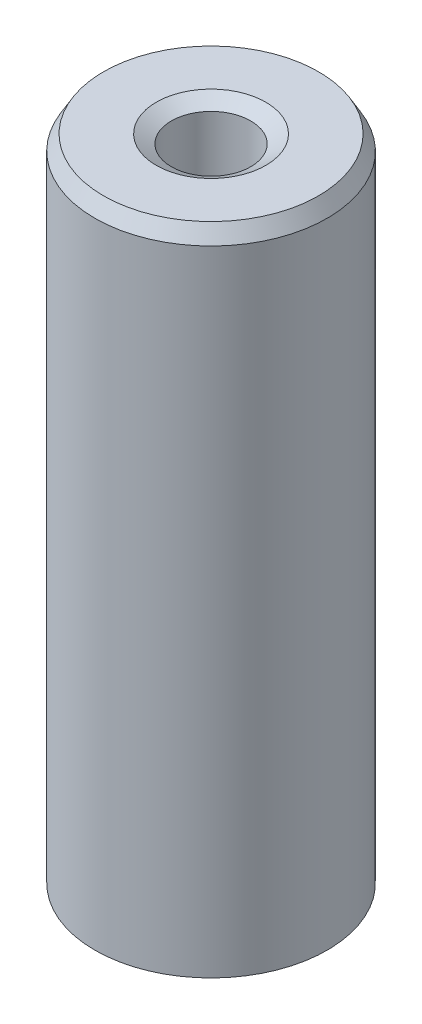
ISO-10303-21;
HEADER;
FILE_DESCRIPTION(('STEP AP214'),'2;1');
FILE_NAME('part.step','',(''),(''),'','','');
FILE_SCHEMA(('AUTOMOTIVE_DESIGN { 1 0 10303 214 1 1 1 1 }'));
ENDSEC;
DATA;
#1=APPLICATION_CONTEXT('core data for automotive mechanical design processes');
#2=APPLICATION_PROTOCOL_DEFINITION('international standard','automotive_design',2000,#1);
#3=PRODUCT_CONTEXT('',#1,'mechanical');
#4=PRODUCT('Part','Part','',(#3));
#5=PRODUCT_RELATED_PRODUCT_CATEGORY('part','',(#4));
#6=PRODUCT_DEFINITION_FORMATION('','',#4);
#7=PRODUCT_DEFINITION_CONTEXT('part definition',#1,'design');
#8=PRODUCT_DEFINITION('design','',#6,#7);
#9=PRODUCT_DEFINITION_SHAPE('','',#8);
#10=(LENGTH_UNIT() NAMED_UNIT(*) SI_UNIT(.MILLI.,.METRE.));
#11=(NAMED_UNIT(*) PLANE_ANGLE_UNIT() SI_UNIT($,.RADIAN.));
#12=(NAMED_UNIT(*) SI_UNIT($,.STERADIAN.) SOLID_ANGLE_UNIT());
#13=UNCERTAINTY_MEASURE_WITH_UNIT(LENGTH_MEASURE(1.E-05),#10,'distance_accuracy_value','');
#14=(GEOMETRIC_REPRESENTATION_CONTEXT(3) GLOBAL_UNCERTAINTY_ASSIGNED_CONTEXT((#13)) GLOBAL_UNIT_ASSIGNED_CONTEXT((#10,
#11,#12)) REPRESENTATION_CONTEXT('',''));
#15=CARTESIAN_POINT('',(0.,0.,0.));
#16=DIRECTION('',(0.,0.,1.));
#17=DIRECTION('',(1.,0.,0.));
#18=AXIS2_PLACEMENT_3D('',#15,#16,#17);
#19=CARTESIAN_POINT('',(0.,70.7378202378607,0.));
#20=DIRECTION('',(0.,-1.,0.));
#21=DIRECTION('',(0.,0.,-1.));
#22=AXIS2_PLACEMENT_3D('',#19,#20,#21);
#23=CYLINDRICAL_SURFACE('',#22,12.5);
#24=CARTESIAN_POINT('',(0.,0.935077518153887,0.));
#25=DIRECTION('',(0.,1.,0.));
#26=DIRECTION('',(0.,0.,1.));
#27=AXIS2_PLACEMENT_3D('',#24,#25,#26);
#28=CIRCLE('',#27,12.5);
#29=CARTESIAN_POINT('',(0.,0.935077518153887,12.5));
#30=VERTEX_POINT('',#29);
#31=EDGE_CURVE('E10',#30,#30,#28,.T.);
#32=ORIENTED_EDGE('',*,*,#31,.T.);
#33=EDGE_LOOP('',(#32));
#34=FACE_BOUND('',#33,.T.);
#35=CARTESIAN_POINT('',(0.,69.1182184674027,0.));
#36=DIRECTION('',(0.,1.,0.));
#37=DIRECTION('',(0.,0.,1.));
#38=AXIS2_PLACEMENT_3D('',#35,#36,#37);
#39=CIRCLE('',#38,12.5);
#40=CARTESIAN_POINT('',(0.,69.1182184674027,12.5));
#41=VERTEX_POINT('',#40);
#42=EDGE_CURVE('E50',#41,#41,#39,.F.);
#43=ORIENTED_EDGE('',*,*,#42,.T.);
#44=EDGE_LOOP('',(#43));
#45=FACE_BOUND('',#44,.T.);
#46=ADVANCED_FACE('F39',(#34,#45),#23,.T.);
#47=CARTESIAN_POINT('',(0.,70.7378202378607,0.));
#48=DIRECTION('',(0.,1.,0.));
#49=DIRECTION('',(0.,0.,1.));
#50=AXIS2_PLACEMENT_3D('',#47,#48,#49);
#51=PLANE('',#50);
#52=CARTESIAN_POINT('',(0.,70.7378202378607,0.));
#53=DIRECTION('',(0.,1.,0.));
#54=DIRECTION('',(0.,0.,1.));
#55=AXIS2_PLACEMENT_3D('',#52,#53,#54);
#56=CIRCLE('',#55,5.89138967959935);
#57=CARTESIAN_POINT('',(0.,70.7378202378607,5.89138967959935));
#58=VERTEX_POINT('',#57);
#59=EDGE_CURVE('E58',#58,#58,#56,.F.);
#60=ORIENTED_EDGE('',*,*,#59,.T.);
#61=EDGE_LOOP('',(#60));
#62=FACE_BOUND('',#61,.T.);
#63=CARTESIAN_POINT('',(0.,70.7378202378607,0.));
#64=DIRECTION('',(0.,1.,0.));
#65=DIRECTION('',(0.,0.,1.));
#66=AXIS2_PLACEMENT_3D('',#63,#64,#65);
#67=CIRCLE('',#66,11.5649224818461);
#68=CARTESIAN_POINT('',(0.,70.7378202378607,11.5649224818461));
#69=VERTEX_POINT('',#68);
#70=EDGE_CURVE('E61',#69,#69,#67,.T.);
#71=ORIENTED_EDGE('',*,*,#70,.T.);
#72=EDGE_LOOP('',(#71));
#73=FACE_BOUND('',#72,.T.);
#74=ADVANCED_FACE('F88',(#62,#73),#51,.T.);
#75=CARTESIAN_POINT('',(0.,0.,0.));
#76=DIRECTION('',(0.,1.,0.));
#77=DIRECTION('',(0.,0.,1.));
#78=AXIS2_PLACEMENT_3D('',#75,#76,#77);
#79=PLANE('',#78);
#80=CARTESIAN_POINT('',(0.,0.,0.));
#81=DIRECTION('',(0.,1.,0.));
#82=DIRECTION('',(0.,0.,1.));
#83=AXIS2_PLACEMENT_3D('',#80,#81,#82);
#84=CIRCLE('',#83,5.20686542729529);
#85=CARTESIAN_POINT('',(0.,0.,5.20686542729529));
#86=VERTEX_POINT('',#85);
#87=EDGE_CURVE('E51',#86,#86,#84,.T.);
#88=ORIENTED_EDGE('',*,*,#87,.T.);
#89=EDGE_LOOP('',(#88));
#90=FACE_BOUND('',#89,.T.);
#91=CARTESIAN_POINT('',(0.,0.,0.));
#92=DIRECTION('',(0.,1.,0.));
#93=DIRECTION('',(0.,0.,1.));
#94=AXIS2_PLACEMENT_3D('',#91,#92,#93);
#95=CIRCLE('',#94,10.880398229542);
#96=CARTESIAN_POINT('',(0.,0.,10.880398229542));
#97=VERTEX_POINT('',#96);
#98=EDGE_CURVE('E54',#97,#97,#95,.F.);
#99=ORIENTED_EDGE('',*,*,#98,.T.);
#100=EDGE_LOOP('',(#99));
#101=FACE_BOUND('',#100,.T.);
#102=ADVANCED_FACE('F83',(#90,#101),#79,.F.);
#103=CARTESIAN_POINT('',(0.,70.7378202378607,0.));
#104=DIRECTION('',(0.,-1.,0.));
#105=DIRECTION('',(0.,0.,-1.));
#106=AXIS2_PLACEMENT_3D('',#103,#104,#105);
#107=CYLINDRICAL_SURFACE('',#106,4.2717879091414);
#108=CARTESIAN_POINT('',(0.,69.8027427197068,0.));
#109=DIRECTION('',(0.,1.,0.));
#110=DIRECTION('',(0.,0.,1.));
#111=AXIS2_PLACEMENT_3D('',#108,#109,#110);
#112=CIRCLE('',#111,4.2717879091414);
#113=CARTESIAN_POINT('',(0.,69.8027427197068,4.2717879091414));
#114=VERTEX_POINT('',#113);
#115=EDGE_CURVE('E67',#114,#114,#112,.T.);
#116=ORIENTED_EDGE('',*,*,#115,.T.);
#117=EDGE_LOOP('',(#116));
#118=FACE_BOUND('',#117,.T.);
#119=CARTESIAN_POINT('',(0.,1.61960177045796,0.));
#120=DIRECTION('',(0.,1.,0.));
#121=DIRECTION('',(0.,0.,1.));
#122=AXIS2_PLACEMENT_3D('',#119,#120,#121);
#123=CIRCLE('',#122,4.2717879091414);
#124=CARTESIAN_POINT('',(0.,1.61960177045796,4.2717879091414));
#125=VERTEX_POINT('',#124);
#126=EDGE_CURVE('E69',#125,#125,#123,.F.);
#127=ORIENTED_EDGE('',*,*,#126,.T.);
#128=EDGE_LOOP('',(#127));
#129=FACE_BOUND('',#128,.T.);
#130=ADVANCED_FACE('F71',(#118,#129),#107,.F.);
#131=CARTESIAN_POINT('',(0.,69.8027427197068,0.));
#132=DIRECTION('',(0.,1.,0.));
#133=DIRECTION('',(0.,0.,1.));
#134=AXIS2_PLACEMENT_3D('',#131,#132,#133);
#135=CONICAL_SURFACE('',#134,4.2717879091414,1.0471975511966);
#136=ORIENTED_EDGE('',*,*,#59,.F.);
#137=EDGE_LOOP('',(#136));
#138=FACE_BOUND('',#137,.T.);
#139=ORIENTED_EDGE('',*,*,#115,.F.);
#140=EDGE_LOOP('',(#139));
#141=FACE_BOUND('',#140,.T.);
#142=ADVANCED_FACE('F77',(#138,#141),#135,.F.);
#143=CARTESIAN_POINT('',(0.,0.,0.));
#144=DIRECTION('',(0.,-1.,0.));
#145=DIRECTION('',(0.,0.,-1.));
#146=AXIS2_PLACEMENT_3D('',#143,#144,#145);
#147=CONICAL_SURFACE('',#146,5.20686542729529,0.523598775598295);
#148=ORIENTED_EDGE('',*,*,#126,.F.);
#149=EDGE_LOOP('',(#148));
#150=FACE_BOUND('',#149,.T.);
#151=ORIENTED_EDGE('',*,*,#87,.F.);
#152=EDGE_LOOP('',(#151));
#153=FACE_BOUND('',#152,.T.);
#154=ADVANCED_FACE('F73',(#150,#153),#147,.F.);
#155=CARTESIAN_POINT('',(0.,0.935077518153887,0.));
#156=DIRECTION('',(0.,1.,0.));
#157=DIRECTION('',(0.,0.,1.));
#158=AXIS2_PLACEMENT_3D('',#155,#156,#157);
#159=CONICAL_SURFACE('',#158,12.5,1.0471975511966);
#160=ORIENTED_EDGE('',*,*,#98,.F.);
#161=EDGE_LOOP('',(#160));
#162=FACE_BOUND('',#161,.T.);
#163=ORIENTED_EDGE('',*,*,#31,.F.);
#164=EDGE_LOOP('',(#163));
#165=FACE_BOUND('',#164,.T.);
#166=ADVANCED_FACE('F76',(#162,#165),#159,.T.);
#167=CARTESIAN_POINT('',(0.,70.7378202378607,0.));
#168=DIRECTION('',(0.,-1.,0.));
#169=DIRECTION('',(0.,0.,-1.));
#170=AXIS2_PLACEMENT_3D('',#167,#168,#169);
#171=CONICAL_SURFACE('',#170,11.5649224818461,0.523598775598299);
#172=ORIENTED_EDGE('',*,*,#42,.F.);
#173=EDGE_LOOP('',(#172));
#174=FACE_BOUND('',#173,.T.);
#175=ORIENTED_EDGE('',*,*,#70,.F.);
#176=EDGE_LOOP('',(#175));
#177=FACE_BOUND('',#176,.T.);
#178=ADVANCED_FACE('F45',(#174,#177),#171,.T.);
#179=CLOSED_SHELL('',(#46,#74,#102,#130,#142,#154,#166,#178));
#180=MANIFOLD_SOLID_BREP('B2',#179);
#181=ADVANCED_BREP_SHAPE_REPRESENTATION('',(#18,#180),#14);
#182=SHAPE_DEFINITION_REPRESENTATION(#9,#181);
ENDSEC;
END-ISO-10303-21;
